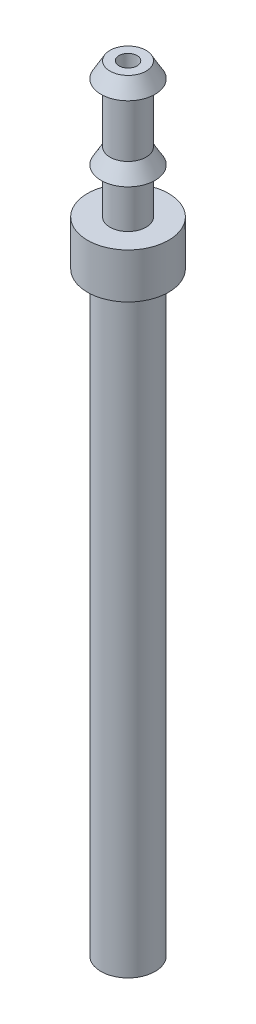
ISO-10303-21;
HEADER;
FILE_DESCRIPTION(('STEP AP214'),'2;1');
FILE_NAME('part.step','',(''),(''),'','','');
FILE_SCHEMA(('AUTOMOTIVE_DESIGN { 1 0 10303 214 1 1 1 1 }'));
ENDSEC;
DATA;
#1=APPLICATION_CONTEXT('core data for automotive mechanical design processes');
#2=APPLICATION_PROTOCOL_DEFINITION('international standard','automotive_design',2000,#1);
#3=PRODUCT_CONTEXT('',#1,'mechanical');
#4=PRODUCT('Part','Part','',(#3));
#5=PRODUCT_RELATED_PRODUCT_CATEGORY('part','',(#4));
#6=PRODUCT_DEFINITION_FORMATION('','',#4);
#7=PRODUCT_DEFINITION_CONTEXT('part definition',#1,'design');
#8=PRODUCT_DEFINITION('design','',#6,#7);
#9=PRODUCT_DEFINITION_SHAPE('','',#8);
#10=(LENGTH_UNIT() NAMED_UNIT(*) SI_UNIT(.MILLI.,.METRE.));
#11=(NAMED_UNIT(*) PLANE_ANGLE_UNIT() SI_UNIT($,.RADIAN.));
#12=(NAMED_UNIT(*) SI_UNIT($,.STERADIAN.) SOLID_ANGLE_UNIT());
#13=UNCERTAINTY_MEASURE_WITH_UNIT(LENGTH_MEASURE(1.E-05),#10,'distance_accuracy_value','');
#14=(GEOMETRIC_REPRESENTATION_CONTEXT(3) GLOBAL_UNCERTAINTY_ASSIGNED_CONTEXT((#13)) GLOBAL_UNIT_ASSIGNED_CONTEXT((#10,
#11,#12)) REPRESENTATION_CONTEXT('',''));
#15=CARTESIAN_POINT('',(0.,0.,0.));
#16=DIRECTION('',(0.,0.,1.));
#17=DIRECTION('',(1.,0.,0.));
#18=AXIS2_PLACEMENT_3D('',#15,#16,#17);
#19=CARTESIAN_POINT('',(0.,0.,0.));
#20=DIRECTION('',(0.,-1.,0.));
#21=DIRECTION('',(0.,0.,-1.));
#22=AXIS2_PLACEMENT_3D('',#19,#20,#21);
#23=CYLINDRICAL_SURFACE('',#22,3.);
#24=CARTESIAN_POINT('',(0.,-66.,0.));
#25=DIRECTION('',(0.,-1.,0.));
#26=DIRECTION('',(0.,0.,-1.));
#27=AXIS2_PLACEMENT_3D('',#24,#25,#26);
#28=CIRCLE('',#27,2.99999999999999);
#29=CARTESIAN_POINT('',(0.,-66.,-2.99999999999999));
#30=VERTEX_POINT('',#29);
#31=EDGE_CURVE('E10',#30,#30,#28,.T.);
#32=ORIENTED_EDGE('',*,*,#31,.F.);
#33=EDGE_LOOP('',(#32));
#34=FACE_BOUND('',#33,.T.);
#35=CARTESIAN_POINT('',(0.,0.,0.));
#36=DIRECTION('',(0.,-1.,0.));
#37=DIRECTION('',(0.,0.,-1.));
#38=AXIS2_PLACEMENT_3D('',#35,#36,#37);
#39=CIRCLE('',#38,3.);
#40=CARTESIAN_POINT('',(0.,0.,-3.));
#41=VERTEX_POINT('',#40);
#42=EDGE_CURVE('E77',#41,#41,#39,.T.);
#43=ORIENTED_EDGE('',*,*,#42,.T.);
#44=EDGE_LOOP('',(#43));
#45=FACE_BOUND('',#44,.T.);
#46=ADVANCED_FACE('F34',(#34,#45),#23,.T.);
#47=CARTESIAN_POINT('',(-0.999999999999992,-66.,0.));
#48=DIRECTION('',(0.,1.,0.));
#49=DIRECTION('',(0.,0.,1.));
#50=AXIS2_PLACEMENT_3D('',#47,#48,#49);
#51=PLANE('',#50);
#52=CARTESIAN_POINT('',(0.,-66.,0.));
#53=DIRECTION('',(0.,-1.,0.));
#54=DIRECTION('',(0.,0.,-1.));
#55=AXIS2_PLACEMENT_3D('',#52,#53,#54);
#56=CIRCLE('',#55,0.999999999999992);
#57=CARTESIAN_POINT('',(0.,-66.,-0.999999999999992));
#58=VERTEX_POINT('',#57);
#59=EDGE_CURVE('E40',#58,#58,#56,.T.);
#60=ORIENTED_EDGE('',*,*,#59,.F.);
#61=EDGE_LOOP('',(#60));
#62=FACE_BOUND('',#61,.T.);
#63=ORIENTED_EDGE('',*,*,#31,.T.);
#64=EDGE_LOOP('',(#63));
#65=FACE_BOUND('',#64,.T.);
#66=ADVANCED_FACE('F144',(#62,#65),#51,.F.);
#67=CARTESIAN_POINT('',(0.,0.,0.));
#68=DIRECTION('',(0.,-1.,0.));
#69=DIRECTION('',(0.,0.,-1.));
#70=AXIS2_PLACEMENT_3D('',#67,#68,#69);
#71=CYLINDRICAL_SURFACE('',#70,0.999999999999997);
#72=CARTESIAN_POINT('',(0.,20.,0.));
#73=DIRECTION('',(0.,-1.,0.));
#74=DIRECTION('',(0.,0.,-1.));
#75=AXIS2_PLACEMENT_3D('',#72,#73,#74);
#76=CIRCLE('',#75,1.);
#77=CARTESIAN_POINT('',(0.,20.,-1.));
#78=VERTEX_POINT('',#77);
#79=EDGE_CURVE('E44',#78,#78,#76,.T.);
#80=ORIENTED_EDGE('',*,*,#79,.F.);
#81=EDGE_LOOP('',(#80));
#82=FACE_BOUND('',#81,.T.);
#83=ORIENTED_EDGE('',*,*,#59,.T.);
#84=EDGE_LOOP('',(#83));
#85=FACE_BOUND('',#84,.T.);
#86=ADVANCED_FACE('F139',(#82,#85),#71,.F.);
#87=CARTESIAN_POINT('',(-2.,20.,0.));
#88=DIRECTION('',(0.,-1.,0.));
#89=DIRECTION('',(0.,0.,-1.));
#90=AXIS2_PLACEMENT_3D('',#87,#88,#89);
#91=PLANE('',#90);
#92=CARTESIAN_POINT('',(0.,20.,0.));
#93=DIRECTION('',(0.,-1.,0.));
#94=DIRECTION('',(0.,0.,-1.));
#95=AXIS2_PLACEMENT_3D('',#92,#93,#94);
#96=CIRCLE('',#95,2.);
#97=CARTESIAN_POINT('',(0.,20.,-2.));
#98=VERTEX_POINT('',#97);
#99=EDGE_CURVE('E48',#98,#98,#96,.T.);
#100=ORIENTED_EDGE('',*,*,#99,.F.);
#101=EDGE_LOOP('',(#100));
#102=FACE_BOUND('',#101,.T.);
#103=ORIENTED_EDGE('',*,*,#79,.T.);
#104=EDGE_LOOP('',(#103));
#105=FACE_BOUND('',#104,.T.);
#106=ADVANCED_FACE('F133',(#102,#105),#91,.F.);
#107=CARTESIAN_POINT('',(0.,20.,0.));
#108=DIRECTION('',(0.,-1.,0.));
#109=DIRECTION('',(0.,0.,-1.));
#110=AXIS2_PLACEMENT_3D('',#107,#108,#109);
#111=CONICAL_SURFACE('',#110,2.,0.523598775598303);
#112=CARTESIAN_POINT('',(0.,18.2679491924311,0.));
#113=DIRECTION('',(0.,-1.,0.));
#114=DIRECTION('',(0.,0.,-1.));
#115=AXIS2_PLACEMENT_3D('',#112,#113,#114);
#116=CIRCLE('',#115,3.);
#117=CARTESIAN_POINT('',(0.,18.2679491924311,-3.));
#118=VERTEX_POINT('',#117);
#119=EDGE_CURVE('E53',#118,#118,#116,.T.);
#120=ORIENTED_EDGE('',*,*,#119,.F.);
#121=EDGE_LOOP('',(#120));
#122=FACE_BOUND('',#121,.T.);
#123=ORIENTED_EDGE('',*,*,#99,.T.);
#124=EDGE_LOOP('',(#123));
#125=FACE_BOUND('',#124,.T.);
#126=ADVANCED_FACE('F127',(#122,#125),#111,.T.);
#127=CARTESIAN_POINT('',(-2.,18.2679491924311,0.));
#128=DIRECTION('',(0.,1.,0.));
#129=DIRECTION('',(0.,0.,1.));
#130=AXIS2_PLACEMENT_3D('',#127,#128,#129);
#131=PLANE('',#130);
#132=CARTESIAN_POINT('',(0.,18.2679491924311,0.));
#133=DIRECTION('',(0.,-1.,0.));
#134=DIRECTION('',(0.,0.,-1.));
#135=AXIS2_PLACEMENT_3D('',#132,#133,#134);
#136=CIRCLE('',#135,2.);
#137=CARTESIAN_POINT('',(0.,18.2679491924311,-2.));
#138=VERTEX_POINT('',#137);
#139=EDGE_CURVE('E56',#138,#138,#136,.T.);
#140=ORIENTED_EDGE('',*,*,#139,.F.);
#141=EDGE_LOOP('',(#140));
#142=FACE_BOUND('',#141,.T.);
#143=ORIENTED_EDGE('',*,*,#119,.T.);
#144=EDGE_LOOP('',(#143));
#145=FACE_BOUND('',#144,.T.);
#146=ADVANCED_FACE('F121',(#142,#145),#131,.F.);
#147=CARTESIAN_POINT('',(0.,0.,0.));
#148=DIRECTION('',(0.,-1.,0.));
#149=DIRECTION('',(0.,0.,-1.));
#150=AXIS2_PLACEMENT_3D('',#147,#148,#149);
#151=CYLINDRICAL_SURFACE('',#150,2.);
#152=CARTESIAN_POINT('',(0.,11.7320508075689,0.));
#153=DIRECTION('',(0.,-1.,0.));
#154=DIRECTION('',(0.,0.,-1.));
#155=AXIS2_PLACEMENT_3D('',#152,#153,#154);
#156=CIRCLE('',#155,2.);
#157=CARTESIAN_POINT('',(0.,11.7320508075689,-2.));
#158=VERTEX_POINT('',#157);
#159=EDGE_CURVE('E59',#158,#158,#156,.T.);
#160=ORIENTED_EDGE('',*,*,#159,.F.);
#161=EDGE_LOOP('',(#160));
#162=FACE_BOUND('',#161,.T.);
#163=ORIENTED_EDGE('',*,*,#139,.T.);
#164=EDGE_LOOP('',(#163));
#165=FACE_BOUND('',#164,.T.);
#166=ADVANCED_FACE('F115',(#162,#165),#151,.T.);
#167=CARTESIAN_POINT('',(0.,11.7320508075689,0.));
#168=DIRECTION('',(0.,-1.,0.));
#169=DIRECTION('',(0.,0.,-1.));
#170=AXIS2_PLACEMENT_3D('',#167,#168,#169);
#171=CONICAL_SURFACE('',#170,2.,0.523598775598304);
#172=CARTESIAN_POINT('',(0.,10.,0.));
#173=DIRECTION('',(0.,-1.,0.));
#174=DIRECTION('',(0.,0.,-1.));
#175=AXIS2_PLACEMENT_3D('',#172,#173,#174);
#176=CIRCLE('',#175,3.);
#177=CARTESIAN_POINT('',(0.,10.,-3.));
#178=VERTEX_POINT('',#177);
#179=EDGE_CURVE('E62',#178,#178,#176,.T.);
#180=ORIENTED_EDGE('',*,*,#179,.F.);
#181=EDGE_LOOP('',(#180));
#182=FACE_BOUND('',#181,.T.);
#183=ORIENTED_EDGE('',*,*,#159,.T.);
#184=EDGE_LOOP('',(#183));
#185=FACE_BOUND('',#184,.T.);
#186=ADVANCED_FACE('F109',(#182,#185),#171,.T.);
#187=CARTESIAN_POINT('',(-2.,10.,0.));
#188=DIRECTION('',(0.,1.,0.));
#189=DIRECTION('',(0.,0.,1.));
#190=AXIS2_PLACEMENT_3D('',#187,#188,#189);
#191=PLANE('',#190);
#192=CARTESIAN_POINT('',(0.,10.,0.));
#193=DIRECTION('',(0.,-1.,0.));
#194=DIRECTION('',(0.,0.,-1.));
#195=AXIS2_PLACEMENT_3D('',#192,#193,#194);
#196=CIRCLE('',#195,2.);
#197=CARTESIAN_POINT('',(0.,10.,-2.));
#198=VERTEX_POINT('',#197);
#199=EDGE_CURVE('E65',#198,#198,#196,.T.);
#200=ORIENTED_EDGE('',*,*,#199,.F.);
#201=EDGE_LOOP('',(#200));
#202=FACE_BOUND('',#201,.T.);
#203=ORIENTED_EDGE('',*,*,#179,.T.);
#204=EDGE_LOOP('',(#203));
#205=FACE_BOUND('',#204,.T.);
#206=ADVANCED_FACE('F103',(#202,#205),#191,.F.);
#207=CARTESIAN_POINT('',(0.,0.,0.));
#208=DIRECTION('',(0.,-1.,0.));
#209=DIRECTION('',(0.,0.,-1.));
#210=AXIS2_PLACEMENT_3D('',#207,#208,#209);
#211=CYLINDRICAL_SURFACE('',#210,2.);
#212=CARTESIAN_POINT('',(0.,5.,0.));
#213=DIRECTION('',(0.,-1.,0.));
#214=DIRECTION('',(0.,0.,-1.));
#215=AXIS2_PLACEMENT_3D('',#212,#213,#214);
#216=CIRCLE('',#215,2.);
#217=CARTESIAN_POINT('',(0.,5.,-2.));
#218=VERTEX_POINT('',#217);
#219=EDGE_CURVE('E68',#218,#218,#216,.T.);
#220=ORIENTED_EDGE('',*,*,#219,.F.);
#221=EDGE_LOOP('',(#220));
#222=FACE_BOUND('',#221,.T.);
#223=ORIENTED_EDGE('',*,*,#199,.T.);
#224=EDGE_LOOP('',(#223));
#225=FACE_BOUND('',#224,.T.);
#226=ADVANCED_FACE('F97',(#222,#225),#211,.T.);
#227=CARTESIAN_POINT('',(-4.5,5.,0.));
#228=DIRECTION('',(0.,-1.,0.));
#229=DIRECTION('',(0.,0.,-1.));
#230=AXIS2_PLACEMENT_3D('',#227,#228,#229);
#231=PLANE('',#230);
#232=CARTESIAN_POINT('',(0.,5.,0.));
#233=DIRECTION('',(0.,-1.,0.));
#234=DIRECTION('',(0.,0.,-1.));
#235=AXIS2_PLACEMENT_3D('',#232,#233,#234);
#236=CIRCLE('',#235,4.5);
#237=CARTESIAN_POINT('',(0.,5.,-4.5));
#238=VERTEX_POINT('',#237);
#239=EDGE_CURVE('E71',#238,#238,#236,.T.);
#240=ORIENTED_EDGE('',*,*,#239,.F.);
#241=EDGE_LOOP('',(#240));
#242=FACE_BOUND('',#241,.T.);
#243=ORIENTED_EDGE('',*,*,#219,.T.);
#244=EDGE_LOOP('',(#243));
#245=FACE_BOUND('',#244,.T.);
#246=ADVANCED_FACE('F91',(#242,#245),#231,.F.);
#247=CARTESIAN_POINT('',(0.,0.,0.));
#248=DIRECTION('',(0.,-1.,0.));
#249=DIRECTION('',(0.,0.,-1.));
#250=AXIS2_PLACEMENT_3D('',#247,#248,#249);
#251=CYLINDRICAL_SURFACE('',#250,4.5);
#252=CARTESIAN_POINT('',(0.,0.,0.));
#253=DIRECTION('',(0.,-1.,0.));
#254=DIRECTION('',(0.,0.,-1.));
#255=AXIS2_PLACEMENT_3D('',#252,#253,#254);
#256=CIRCLE('',#255,4.5);
#257=CARTESIAN_POINT('',(0.,0.,-4.5));
#258=VERTEX_POINT('',#257);
#259=EDGE_CURVE('E74',#258,#258,#256,.T.);
#260=ORIENTED_EDGE('',*,*,#259,.F.);
#261=EDGE_LOOP('',(#260));
#262=FACE_BOUND('',#261,.T.);
#263=ORIENTED_EDGE('',*,*,#239,.T.);
#264=EDGE_LOOP('',(#263));
#265=FACE_BOUND('',#264,.T.);
#266=ADVANCED_FACE('F85',(#262,#265),#251,.T.);
#267=CARTESIAN_POINT('',(-3.,0.,0.));
#268=DIRECTION('',(0.,1.,0.));
#269=DIRECTION('',(0.,0.,1.));
#270=AXIS2_PLACEMENT_3D('',#267,#268,#269);
#271=PLANE('',#270);
#272=ORIENTED_EDGE('',*,*,#42,.F.);
#273=EDGE_LOOP('',(#272));
#274=FACE_BOUND('',#273,.T.);
#275=ORIENTED_EDGE('',*,*,#259,.T.);
#276=EDGE_LOOP('',(#275));
#277=FACE_BOUND('',#276,.T.);
#278=ADVANCED_FACE('F82',(#274,#277),#271,.F.);
#279=CLOSED_SHELL('',(#46,#66,#86,#106,#126,#146,#166,#186,#206,#226,#246,#266,#278));
#280=MANIFOLD_SOLID_BREP('B2',#279);
#281=ADVANCED_BREP_SHAPE_REPRESENTATION('',(#18,#280),#14);
#282=SHAPE_DEFINITION_REPRESENTATION(#9,#281);
ENDSEC;
END-ISO-10303-21;
